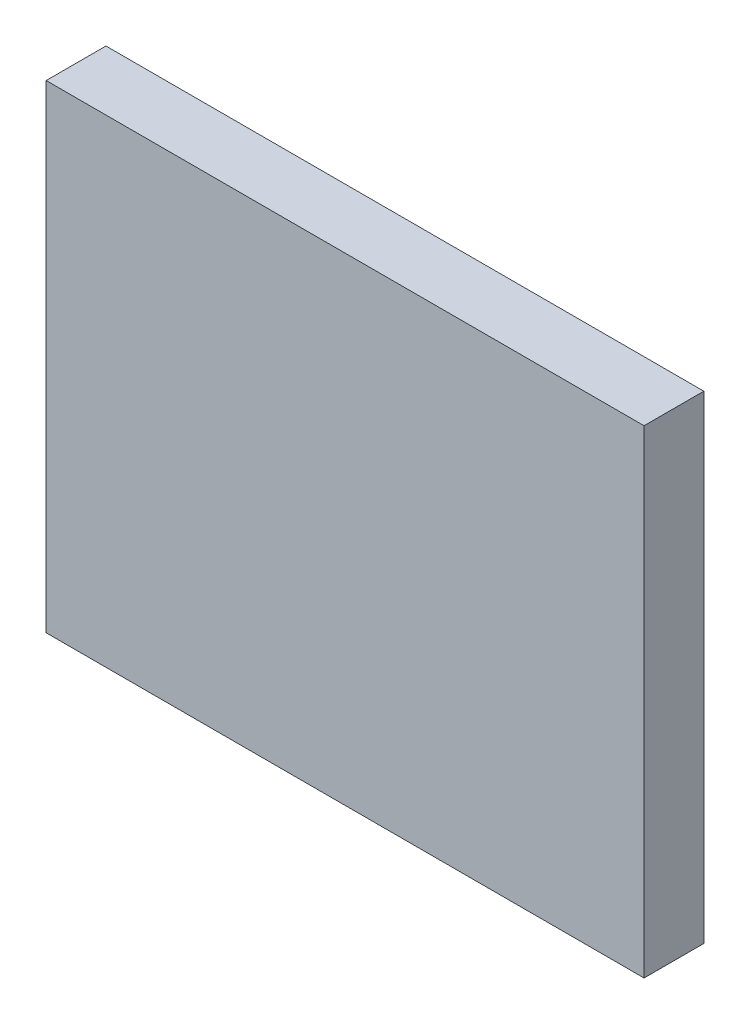
ISO-10303-21;
HEADER;
FILE_DESCRIPTION(('STEP AP214'),'2;1');
FILE_NAME('part.step','',(''),(''),'','','');
FILE_SCHEMA(('AUTOMOTIVE_DESIGN { 1 0 10303 214 1 1 1 1 }'));
ENDSEC;
DATA;
#1=APPLICATION_CONTEXT('core data for automotive mechanical design processes');
#2=APPLICATION_PROTOCOL_DEFINITION('international standard','automotive_design',2000,#1);
#3=PRODUCT_CONTEXT('',#1,'mechanical');
#4=PRODUCT('Part','Part','',(#3));
#5=PRODUCT_RELATED_PRODUCT_CATEGORY('part','',(#4));
#6=PRODUCT_DEFINITION_FORMATION('','',#4);
#7=PRODUCT_DEFINITION_CONTEXT('part definition',#1,'design');
#8=PRODUCT_DEFINITION('design','',#6,#7);
#9=PRODUCT_DEFINITION_SHAPE('','',#8);
#10=(LENGTH_UNIT() NAMED_UNIT(*) SI_UNIT(.MILLI.,.METRE.));
#11=(NAMED_UNIT(*) PLANE_ANGLE_UNIT() SI_UNIT($,.RADIAN.));
#12=(NAMED_UNIT(*) SI_UNIT($,.STERADIAN.) SOLID_ANGLE_UNIT());
#13=UNCERTAINTY_MEASURE_WITH_UNIT(LENGTH_MEASURE(1.E-05),#10,'distance_accuracy_value','');
#14=(GEOMETRIC_REPRESENTATION_CONTEXT(3) GLOBAL_UNCERTAINTY_ASSIGNED_CONTEXT((#13)) GLOBAL_UNIT_ASSIGNED_CONTEXT((#10,
#11,#12)) REPRESENTATION_CONTEXT('',''));
#15=CARTESIAN_POINT('',(0.,0.,0.));
#16=DIRECTION('',(0.,0.,1.));
#17=DIRECTION('',(1.,0.,0.));
#18=AXIS2_PLACEMENT_3D('',#15,#16,#17);
#19=CARTESIAN_POINT('',(2.04,1.55,0.));
#20=DIRECTION('',(1.,0.,0.));
#21=DIRECTION('',(0.,0.,1.));
#22=AXIS2_PLACEMENT_3D('',#19,#20,#21);
#23=PLANE('',#22);
#24=DIRECTION('',(0.,1.,0.));
#25=VECTOR('',#24,1.);
#26=CARTESIAN_POINT('',(2.04,1.55,0.1));
#27=LINE('',#26,#25);
#28=CARTESIAN_POINT('',(2.04,1.55,0.1));
#29=VERTEX_POINT('',#28);
#30=CARTESIAN_POINT('',(2.04,2.35,0.1));
#31=VERTEX_POINT('',#30);
#32=EDGE_CURVE('E11',#29,#31,#27,.T.);
#33=ORIENTED_EDGE('',*,*,#32,.T.);
#34=DIRECTION('',(0.,0.,1.));
#35=VECTOR('',#34,1.);
#36=CARTESIAN_POINT('',(2.04,2.35,0.));
#37=LINE('',#36,#35);
#38=CARTESIAN_POINT('',(2.04,2.35,0.));
#39=VERTEX_POINT('',#38);
#40=EDGE_CURVE('E24',#39,#31,#37,.T.);
#41=ORIENTED_EDGE('',*,*,#40,.F.);
#42=DIRECTION('',(0.,1.,0.));
#43=VECTOR('',#42,1.);
#44=CARTESIAN_POINT('',(2.04,1.55,0.));
#45=LINE('',#44,#43);
#46=CARTESIAN_POINT('',(2.04,1.55,0.));
#47=VERTEX_POINT('',#46);
#48=EDGE_CURVE('E86',#47,#39,#45,.T.);
#49=ORIENTED_EDGE('',*,*,#48,.F.);
#50=DIRECTION('',(0.,0.,1.));
#51=VECTOR('',#50,1.);
#52=CARTESIAN_POINT('',(2.04,1.55,0.));
#53=LINE('',#52,#51);
#54=EDGE_CURVE('E36',#47,#29,#53,.T.);
#55=ORIENTED_EDGE('',*,*,#54,.T.);
#56=EDGE_LOOP('',(#33,#41,#49,#55));
#57=FACE_BOUND('',#56,.T.);
#58=ADVANCED_FACE('F17',(#57),#23,.F.);
#59=CARTESIAN_POINT('',(3.04,1.55,0.));
#60=DIRECTION('',(1.,0.,0.));
#61=DIRECTION('',(0.,0.,1.));
#62=AXIS2_PLACEMENT_3D('',#59,#60,#61);
#63=PLANE('',#62);
#64=DIRECTION('',(0.,0.,1.));
#65=VECTOR('',#64,1.);
#66=CARTESIAN_POINT('',(3.04,1.55,0.));
#67=LINE('',#66,#65);
#68=CARTESIAN_POINT('',(3.04,1.55,0.));
#69=VERTEX_POINT('',#68);
#70=CARTESIAN_POINT('',(3.04,1.55,0.1));
#71=VERTEX_POINT('',#70);
#72=EDGE_CURVE('E83',#69,#71,#67,.T.);
#73=ORIENTED_EDGE('',*,*,#72,.F.);
#74=DIRECTION('',(0.,1.,0.));
#75=VECTOR('',#74,1.);
#76=CARTESIAN_POINT('',(3.04,1.55,0.));
#77=LINE('',#76,#75);
#78=CARTESIAN_POINT('',(3.04,2.35,0.));
#79=VERTEX_POINT('',#78);
#80=EDGE_CURVE('E63',#69,#79,#77,.T.);
#81=ORIENTED_EDGE('',*,*,#80,.T.);
#82=DIRECTION('',(0.,0.,1.));
#83=VECTOR('',#82,1.);
#84=CARTESIAN_POINT('',(3.04,2.35,0.));
#85=LINE('',#84,#83);
#86=CARTESIAN_POINT('',(3.04,2.35,0.1));
#87=VERTEX_POINT('',#86);
#88=EDGE_CURVE('E57',#79,#87,#85,.T.);
#89=ORIENTED_EDGE('',*,*,#88,.T.);
#90=DIRECTION('',(0.,1.,0.));
#91=VECTOR('',#90,1.);
#92=CARTESIAN_POINT('',(3.04,1.55,0.1));
#93=LINE('',#92,#91);
#94=EDGE_CURVE('E60',#71,#87,#93,.T.);
#95=ORIENTED_EDGE('',*,*,#94,.F.);
#96=EDGE_LOOP('',(#73,#81,#89,#95));
#97=FACE_BOUND('',#96,.T.);
#98=ADVANCED_FACE('F59',(#97),#63,.T.);
#99=CARTESIAN_POINT('',(2.04,1.55,0.));
#100=DIRECTION('',(0.,1.,0.));
#101=DIRECTION('',(0.,0.,1.));
#102=AXIS2_PLACEMENT_3D('',#99,#100,#101);
#103=PLANE('',#102);
#104=ORIENTED_EDGE('',*,*,#72,.T.);
#105=DIRECTION('',(1.,0.,0.));
#106=VECTOR('',#105,1.);
#107=CARTESIAN_POINT('',(2.04,1.55,0.1));
#108=LINE('',#107,#106);
#109=EDGE_CURVE('E71',#29,#71,#108,.T.);
#110=ORIENTED_EDGE('',*,*,#109,.F.);
#111=ORIENTED_EDGE('',*,*,#54,.F.);
#112=DIRECTION('',(1.,0.,0.));
#113=VECTOR('',#112,1.);
#114=CARTESIAN_POINT('',(2.04,1.55,0.));
#115=LINE('',#114,#113);
#116=EDGE_CURVE('E76',#47,#69,#115,.T.);
#117=ORIENTED_EDGE('',*,*,#116,.T.);
#118=EDGE_LOOP('',(#104,#110,#111,#117));
#119=FACE_BOUND('',#118,.T.);
#120=ADVANCED_FACE('F91',(#119),#103,.F.);
#121=CARTESIAN_POINT('',(2.04,2.35,0.));
#122=DIRECTION('',(0.,1.,0.));
#123=DIRECTION('',(0.,0.,1.));
#124=AXIS2_PLACEMENT_3D('',#121,#122,#123);
#125=PLANE('',#124);
#126=DIRECTION('',(1.,0.,0.));
#127=VECTOR('',#126,1.);
#128=CARTESIAN_POINT('',(2.04,2.35,0.));
#129=LINE('',#128,#127);
#130=EDGE_CURVE('E74',#39,#79,#129,.T.);
#131=ORIENTED_EDGE('',*,*,#130,.F.);
#132=ORIENTED_EDGE('',*,*,#40,.T.);
#133=DIRECTION('',(1.,0.,0.));
#134=VECTOR('',#133,1.);
#135=CARTESIAN_POINT('',(2.04,2.35,0.1));
#136=LINE('',#135,#134);
#137=EDGE_CURVE('E69',#31,#87,#136,.T.);
#138=ORIENTED_EDGE('',*,*,#137,.T.);
#139=ORIENTED_EDGE('',*,*,#88,.F.);
#140=EDGE_LOOP('',(#131,#132,#138,#139));
#141=FACE_BOUND('',#140,.T.);
#142=ADVANCED_FACE('F73',(#141),#125,.T.);
#143=CARTESIAN_POINT('',(2.04,1.55,0.));
#144=DIRECTION('',(0.,0.,1.));
#145=DIRECTION('',(1.,0.,0.));
#146=AXIS2_PLACEMENT_3D('',#143,#144,#145);
#147=PLANE('',#146);
#148=ORIENTED_EDGE('',*,*,#130,.T.);
#149=ORIENTED_EDGE('',*,*,#80,.F.);
#150=ORIENTED_EDGE('',*,*,#116,.F.);
#151=ORIENTED_EDGE('',*,*,#48,.T.);
#152=EDGE_LOOP('',(#148,#149,#150,#151));
#153=FACE_BOUND('',#152,.T.);
#154=ADVANCED_FACE('F89',(#153),#147,.F.);
#155=CARTESIAN_POINT('',(2.04,1.55,0.1));
#156=DIRECTION('',(0.,0.,1.));
#157=DIRECTION('',(1.,0.,0.));
#158=AXIS2_PLACEMENT_3D('',#155,#156,#157);
#159=PLANE('',#158);
#160=ORIENTED_EDGE('',*,*,#32,.F.);
#161=ORIENTED_EDGE('',*,*,#109,.T.);
#162=ORIENTED_EDGE('',*,*,#94,.T.);
#163=ORIENTED_EDGE('',*,*,#137,.F.);
#164=EDGE_LOOP('',(#160,#161,#162,#163));
#165=FACE_BOUND('',#164,.T.);
#166=ADVANCED_FACE('F68',(#165),#159,.T.);
#167=CLOSED_SHELL('',(#58,#98,#120,#142,#154,#166));
#168=MANIFOLD_SOLID_BREP('B1',#167);
#169=ADVANCED_BREP_SHAPE_REPRESENTATION('',(#18,#168),#14);
#170=SHAPE_DEFINITION_REPRESENTATION(#9,#169);
ENDSEC;
END-ISO-10303-21;
